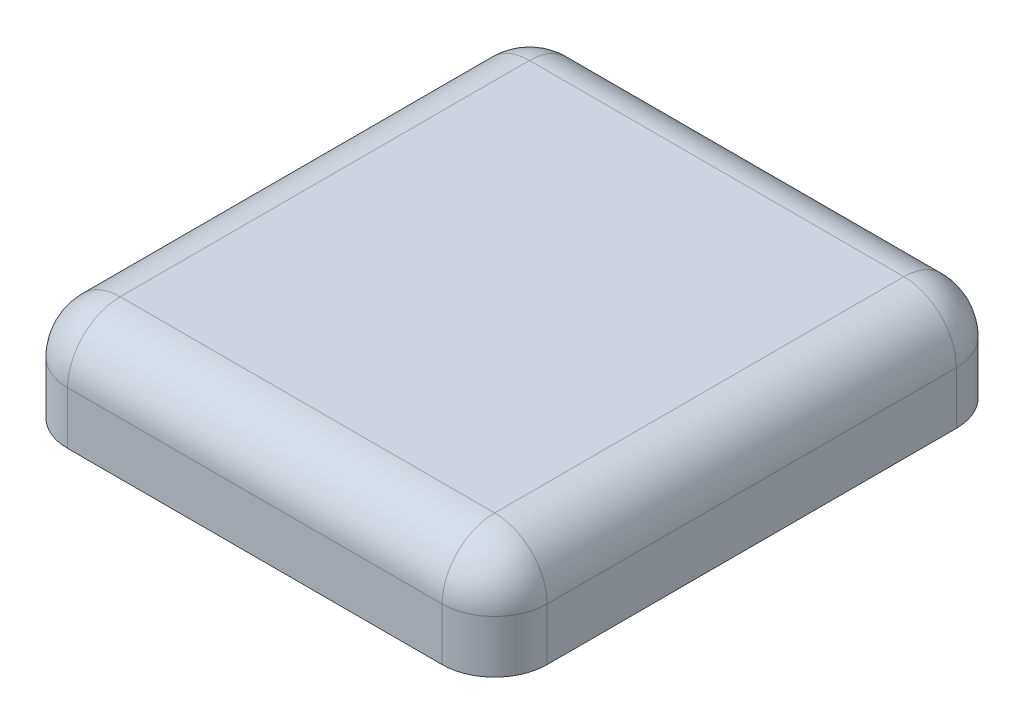
ISO-10303-21;
HEADER;
FILE_DESCRIPTION(('STEP AP214'),'2;1');
FILE_NAME('part.step','',(''),(''),'','','');
FILE_SCHEMA(('AUTOMOTIVE_DESIGN { 1 0 10303 214 1 1 1 1 }'));
ENDSEC;
DATA;
#1=APPLICATION_CONTEXT('core data for automotive mechanical design processes');
#2=APPLICATION_PROTOCOL_DEFINITION('international standard','automotive_design',2000,#1);
#3=PRODUCT_CONTEXT('',#1,'mechanical');
#4=PRODUCT('Part','Part','',(#3));
#5=PRODUCT_RELATED_PRODUCT_CATEGORY('part','',(#4));
#6=PRODUCT_DEFINITION_FORMATION('','',#4);
#7=PRODUCT_DEFINITION_CONTEXT('part definition',#1,'design');
#8=PRODUCT_DEFINITION('design','',#6,#7);
#9=PRODUCT_DEFINITION_SHAPE('','',#8);
#10=(LENGTH_UNIT() NAMED_UNIT(*) SI_UNIT(.MILLI.,.METRE.));
#11=(NAMED_UNIT(*) PLANE_ANGLE_UNIT() SI_UNIT($,.RADIAN.));
#12=(NAMED_UNIT(*) SI_UNIT($,.STERADIAN.) SOLID_ANGLE_UNIT());
#13=UNCERTAINTY_MEASURE_WITH_UNIT(LENGTH_MEASURE(1.E-05),#10,'distance_accuracy_value','');
#14=(GEOMETRIC_REPRESENTATION_CONTEXT(3) GLOBAL_UNCERTAINTY_ASSIGNED_CONTEXT((#13)) GLOBAL_UNIT_ASSIGNED_CONTEXT((#10,
#11,#12)) REPRESENTATION_CONTEXT('',''));
#15=CARTESIAN_POINT('',(0.,0.,0.));
#16=DIRECTION('',(0.,0.,1.));
#17=DIRECTION('',(1.,0.,0.));
#18=AXIS2_PLACEMENT_3D('',#15,#16,#17);
#19=CARTESIAN_POINT('',(0.,2.,0.));
#20=DIRECTION('',(0.,1.,0.));
#21=DIRECTION('',(0.,0.,1.));
#22=AXIS2_PLACEMENT_3D('',#19,#20,#21);
#23=PLANE('',#22);
#24=DIRECTION('',(0.,0.,1.));
#25=VECTOR('',#24,1.);
#26=CARTESIAN_POINT('',(-17.3837209302325,2.,0.));
#27=LINE('',#26,#25);
#28=CARTESIAN_POINT('',(-17.3837209302325,2.,-18.3349688339604));
#29=VERTEX_POINT('',#28);
#30=CARTESIAN_POINT('',(-17.3837209302325,2.,20.5988372093023));
#31=VERTEX_POINT('',#30);
#32=EDGE_CURVE('E218',#29,#31,#27,.T.);
#33=ORIENTED_EDGE('',*,*,#32,.T.);
#34=DIRECTION('',(1.,0.,0.));
#35=VECTOR('',#34,1.);
#36=CARTESIAN_POINT('',(0.,2.,20.5988372093023));
#37=LINE('',#36,#35);
#38=CARTESIAN_POINT('',(18.2443290602305,2.,20.5988372093023));
#39=VERTEX_POINT('',#38);
#40=EDGE_CURVE('E220',#31,#39,#37,.T.);
#41=ORIENTED_EDGE('',*,*,#40,.T.);
#42=DIRECTION('',(0.,0.,1.));
#43=VECTOR('',#42,1.);
#44=CARTESIAN_POINT('',(18.2443290602305,2.,0.));
#45=LINE('',#44,#43);
#46=CARTESIAN_POINT('',(18.2443290602305,2.,-18.3349688339604));
#47=VERTEX_POINT('',#46);
#48=EDGE_CURVE('E214',#39,#47,#45,.F.);
#49=ORIENTED_EDGE('',*,*,#48,.T.);
#50=DIRECTION('',(-1.,0.,0.));
#51=VECTOR('',#50,1.);
#52=CARTESIAN_POINT('',(0.,2.,-18.3349688339604));
#53=LINE('',#52,#51);
#54=EDGE_CURVE('E216',#47,#29,#53,.T.);
#55=ORIENTED_EDGE('',*,*,#54,.T.);
#56=EDGE_LOOP('',(#33,#41,#49,#55));
#57=FACE_BOUND('',#56,.T.);
#58=ADVANCED_FACE('F33',(#57),#23,.T.);
#59=CARTESIAN_POINT('',(0.,0.,0.));
#60=DIRECTION('',(0.,1.,0.));
#61=DIRECTION('',(0.,0.,1.));
#62=AXIS2_PLACEMENT_3D('',#59,#60,#61);
#63=PLANE('',#62);
#64=DIRECTION('',(1.,0.,0.));
#65=VECTOR('',#64,1.);
#66=CARTESIAN_POINT('',(-20.3837209302325,0.,23.5988372093023));
#67=LINE('',#66,#65);
#68=CARTESIAN_POINT('',(-18.3837209302325,0.,23.5988372093023));
#69=VERTEX_POINT('',#68);
#70=CARTESIAN_POINT('',(18.6162790697675,0.,23.5988372093023));
#71=VERTEX_POINT('',#70);
#72=EDGE_CURVE('E306',#69,#71,#67,.T.);
#73=ORIENTED_EDGE('',*,*,#72,.F.);
#74=CARTESIAN_POINT('',(-18.3837209302325,0.,21.5988372093023));
#75=DIRECTION('',(0.,1.,0.));
#76=DIRECTION('',(0.,0.,1.));
#77=AXIS2_PLACEMENT_3D('',#74,#75,#76);
#78=CIRCLE('',#77,2.);
#79=CARTESIAN_POINT('',(-20.3837209302325,0.,21.5988372093023));
#80=VERTEX_POINT('',#79);
#81=EDGE_CURVE('E267',#69,#80,#78,.F.);
#82=ORIENTED_EDGE('',*,*,#81,.T.);
#83=DIRECTION('',(0.,0.,1.));
#84=VECTOR('',#83,1.);
#85=CARTESIAN_POINT('',(-20.3837209302325,0.,-21.4011627906977));
#86=LINE('',#85,#84);
#87=CARTESIAN_POINT('',(-20.3837209302325,0.,-19.4011627906977));
#88=VERTEX_POINT('',#87);
#89=EDGE_CURVE('E309',#88,#80,#86,.T.);
#90=ORIENTED_EDGE('',*,*,#89,.F.);
#91=CARTESIAN_POINT('',(-18.3837209302325,0.,-19.4011627906977));
#92=DIRECTION('',(0.,1.,0.));
#93=DIRECTION('',(0.,0.,1.));
#94=AXIS2_PLACEMENT_3D('',#91,#92,#93);
#95=CIRCLE('',#94,2.);
#96=CARTESIAN_POINT('',(-18.3837209302325,0.,-21.4011627906977));
#97=VERTEX_POINT('',#96);
#98=EDGE_CURVE('E265',#88,#97,#95,.F.);
#99=ORIENTED_EDGE('',*,*,#98,.T.);
#100=DIRECTION('',(-1.,0.,0.));
#101=VECTOR('',#100,1.);
#102=CARTESIAN_POINT('',(-20.3837209302325,0.,-21.4011627906977));
#103=LINE('',#102,#101);
#104=CARTESIAN_POINT('',(18.6162790697675,0.,-21.4011627906977));
#105=VERTEX_POINT('',#104);
#106=EDGE_CURVE('E189',#105,#97,#103,.T.);
#107=ORIENTED_EDGE('',*,*,#106,.F.);
#108=CARTESIAN_POINT('',(18.6162790697675,0.,-19.4011627906977));
#109=DIRECTION('',(0.,1.,0.));
#110=DIRECTION('',(0.,0.,1.));
#111=AXIS2_PLACEMENT_3D('',#108,#109,#110);
#112=CIRCLE('',#111,2.);
#113=CARTESIAN_POINT('',(20.6162790697675,0.,-19.4011627906977));
#114=VERTEX_POINT('',#113);
#115=EDGE_CURVE('E263',#105,#114,#112,.F.);
#116=ORIENTED_EDGE('',*,*,#115,.T.);
#117=DIRECTION('',(0.,0.,-1.));
#118=VECTOR('',#117,1.);
#119=CARTESIAN_POINT('',(20.6162790697675,0.,-21.4011627906977));
#120=LINE('',#119,#118);
#121=CARTESIAN_POINT('',(20.6162790697675,0.,21.5988372093023));
#122=VERTEX_POINT('',#121);
#123=EDGE_CURVE('E302',#122,#114,#120,.T.);
#124=ORIENTED_EDGE('',*,*,#123,.F.);
#125=CARTESIAN_POINT('',(18.6162790697675,0.,21.5988372093023));
#126=DIRECTION('',(0.,1.,0.));
#127=DIRECTION('',(0.,0.,1.));
#128=AXIS2_PLACEMENT_3D('',#125,#126,#127);
#129=CIRCLE('',#128,2.);
#130=EDGE_CURVE('E261',#122,#71,#129,.F.);
#131=ORIENTED_EDGE('',*,*,#130,.T.);
#132=EDGE_LOOP('',(#73,#82,#90,#99,#107,#116,#124,#131));
#133=FACE_BOUND('',#132,.T.);
#134=ADVANCED_FACE('F301',(#133),#63,.F.);
#135=CARTESIAN_POINT('',(-20.3837209302325,-8.,23.5988372093023));
#136=DIRECTION('',(0.,0.,-1.));
#137=DIRECTION('',(-1.,0.,0.));
#138=AXIS2_PLACEMENT_3D('',#135,#136,#137);
#139=PLANE('',#138);
#140=DIRECTION('',(-1.,0.,0.));
#141=VECTOR('',#140,1.);
#142=CARTESIAN_POINT('',(-20.3837209302325,-8.,23.5988372093023));
#143=LINE('',#142,#141);
#144=CARTESIAN_POINT('',(18.6162790697675,-8.,23.5988372093023));
#145=VERTEX_POINT('',#144);
#146=CARTESIAN_POINT('',(-18.3837209302325,-8.,23.5988372093023));
#147=VERTEX_POINT('',#146);
#148=EDGE_CURVE('E314',#145,#147,#143,.T.);
#149=ORIENTED_EDGE('',*,*,#148,.T.);
#150=DIRECTION('',(0.,1.,0.));
#151=VECTOR('',#150,1.);
#152=CARTESIAN_POINT('',(-18.3837209302325,0.,23.5988372093023));
#153=LINE('',#152,#151);
#154=EDGE_CURVE('E258',#147,#69,#153,.T.);
#155=ORIENTED_EDGE('',*,*,#154,.T.);
#156=ORIENTED_EDGE('',*,*,#72,.T.);
#157=DIRECTION('',(0.,1.,0.));
#158=VECTOR('',#157,1.);
#159=CARTESIAN_POINT('',(18.6162790697675,-8.,23.5988372093023));
#160=LINE('',#159,#158);
#161=EDGE_CURVE('E223',#71,#145,#160,.F.);
#162=ORIENTED_EDGE('',*,*,#161,.T.);
#163=EDGE_LOOP('',(#149,#155,#156,#162));
#164=FACE_BOUND('',#163,.T.);
#165=ADVANCED_FACE('F340',(#164),#139,.T.);
#166=CARTESIAN_POINT('',(-20.3837209302325,-8.,25.5988372093023));
#167=DIRECTION('',(0.,0.,1.));
#168=DIRECTION('',(1.,0.,0.));
#169=AXIS2_PLACEMENT_3D('',#166,#167,#168);
#170=PLANE('',#169);
#171=DIRECTION('',(1.,0.,0.));
#172=VECTOR('',#171,1.);
#173=CARTESIAN_POINT('',(-20.3837209302325,-8.,25.5988372093023));
#174=LINE('',#173,#172);
#175=CARTESIAN_POINT('',(-17.3837209302325,-8.,25.5988372093023));
#176=VERTEX_POINT('',#175);
#177=CARTESIAN_POINT('',(18.2443290602305,-8.,25.5988372093023));
#178=VERTEX_POINT('',#177);
#179=EDGE_CURVE('E317',#176,#178,#174,.T.);
#180=ORIENTED_EDGE('',*,*,#179,.T.);
#181=DIRECTION('',(0.,-1.,0.));
#182=VECTOR('',#181,1.);
#183=CARTESIAN_POINT('',(18.2443290602305,-8.,25.5988372093023));
#184=LINE('',#183,#182);
#185=CARTESIAN_POINT('',(18.2443290602305,-3.,25.5988372093023));
#186=VERTEX_POINT('',#185);
#187=EDGE_CURVE('E200',#178,#186,#184,.F.);
#188=ORIENTED_EDGE('',*,*,#187,.T.);
#189=DIRECTION('',(1.,0.,0.));
#190=VECTOR('',#189,1.);
#191=CARTESIAN_POINT('',(-20.3837209302325,-3.,25.5988372093023));
#192=LINE('',#191,#190);
#193=CARTESIAN_POINT('',(-17.3837209302325,-3.,25.5988372093023));
#194=VERTEX_POINT('',#193);
#195=EDGE_CURVE('E196',#186,#194,#192,.F.);
#196=ORIENTED_EDGE('',*,*,#195,.T.);
#197=DIRECTION('',(0.,1.,0.));
#198=VECTOR('',#197,1.);
#199=CARTESIAN_POINT('',(-17.3837209302325,-8.,25.5988372093023));
#200=LINE('',#199,#198);
#201=EDGE_CURVE('E198',#194,#176,#200,.F.);
#202=ORIENTED_EDGE('',*,*,#201,.T.);
#203=EDGE_LOOP('',(#180,#188,#196,#202));
#204=FACE_BOUND('',#203,.T.);
#205=ADVANCED_FACE('F355',(#204),#170,.T.);
#206=CARTESIAN_POINT('',(0.,-8.,0.));
#207=DIRECTION('',(0.,1.,0.));
#208=DIRECTION('',(0.,0.,1.));
#209=AXIS2_PLACEMENT_3D('',#206,#207,#208);
#210=PLANE('',#209);
#211=DIRECTION('',(0.,0.,1.));
#212=VECTOR('',#211,1.);
#213=CARTESIAN_POINT('',(23.2443290602305,-8.,25.5988372093023));
#214=LINE('',#213,#212);
#215=CARTESIAN_POINT('',(23.2443290602305,-8.,-18.3349688339604));
#216=VERTEX_POINT('',#215);
#217=CARTESIAN_POINT('',(23.2443290602305,-8.,20.5988372093023));
#218=VERTEX_POINT('',#217);
#219=EDGE_CURVE('E162',#216,#218,#214,.T.);
#220=ORIENTED_EDGE('',*,*,#219,.T.);
#221=CARTESIAN_POINT('',(18.2443290602305,-8.,20.5988372093023));
#222=DIRECTION('',(0.,1.,0.));
#223=DIRECTION('',(0.,0.,1.));
#224=AXIS2_PLACEMENT_3D('',#221,#222,#223);
#225=CIRCLE('',#224,5.);
#226=EDGE_CURVE('E168',#218,#178,#225,.F.);
#227=ORIENTED_EDGE('',*,*,#226,.T.);
#228=ORIENTED_EDGE('',*,*,#179,.F.);
#229=CARTESIAN_POINT('',(-17.3837209302325,-8.,20.5988372093023));
#230=DIRECTION('',(0.,1.,0.));
#231=DIRECTION('',(0.,0.,1.));
#232=AXIS2_PLACEMENT_3D('',#229,#230,#231);
#233=CIRCLE('',#232,5.);
#234=CARTESIAN_POINT('',(-22.3837209302325,-8.,20.5988372093023));
#235=VERTEX_POINT('',#234);
#236=EDGE_CURVE('E169',#176,#235,#233,.F.);
#237=ORIENTED_EDGE('',*,*,#236,.T.);
#238=DIRECTION('',(0.,0.,1.));
#239=VECTOR('',#238,1.);
#240=CARTESIAN_POINT('',(-22.3837209302325,-8.,-23.3349688339604));
#241=LINE('',#240,#239);
#242=CARTESIAN_POINT('',(-22.3837209302325,-8.,-18.3349688339604));
#243=VERTEX_POINT('',#242);
#244=EDGE_CURVE('E320',#243,#235,#241,.T.);
#245=ORIENTED_EDGE('',*,*,#244,.F.);
#246=CARTESIAN_POINT('',(-17.3837209302325,-8.,-18.3349688339604));
#247=DIRECTION('',(0.,1.,0.));
#248=DIRECTION('',(0.,0.,1.));
#249=AXIS2_PLACEMENT_3D('',#246,#247,#248);
#250=CIRCLE('',#249,5.);
#251=CARTESIAN_POINT('',(-17.3837209302325,-8.,-23.3349688339604));
#252=VERTEX_POINT('',#251);
#253=EDGE_CURVE('E187',#243,#252,#250,.F.);
#254=ORIENTED_EDGE('',*,*,#253,.T.);
#255=DIRECTION('',(-1.,0.,0.));
#256=VECTOR('',#255,1.);
#257=CARTESIAN_POINT('',(-20.3837209302325,-8.,-23.3349688339604));
#258=LINE('',#257,#256);
#259=CARTESIAN_POINT('',(18.2443290602305,-8.,-23.3349688339604));
#260=VERTEX_POINT('',#259);
#261=EDGE_CURVE('E164',#260,#252,#258,.T.);
#262=ORIENTED_EDGE('',*,*,#261,.F.);
#263=CARTESIAN_POINT('',(18.2443290602305,-8.,-18.3349688339604));
#264=DIRECTION('',(0.,1.,0.));
#265=DIRECTION('',(0.,0.,1.));
#266=AXIS2_PLACEMENT_3D('',#263,#264,#265);
#267=CIRCLE('',#266,5.);
#268=EDGE_CURVE('E159',#260,#216,#267,.F.);
#269=ORIENTED_EDGE('',*,*,#268,.T.);
#270=EDGE_LOOP('',(#220,#227,#228,#237,#245,#254,#262,#269));
#271=FACE_BOUND('',#270,.T.);
#272=ORIENTED_EDGE('',*,*,#148,.F.);
#273=CARTESIAN_POINT('',(18.6162790697675,-8.,21.5988372093023));
#274=DIRECTION('',(0.,1.,0.));
#275=DIRECTION('',(0.,0.,1.));
#276=AXIS2_PLACEMENT_3D('',#273,#274,#275);
#277=CIRCLE('',#276,2.);
#278=CARTESIAN_POINT('',(20.6162790697675,-8.,21.5988372093023));
#279=VERTEX_POINT('',#278);
#280=EDGE_CURVE('E11',#145,#279,#277,.T.);
#281=ORIENTED_EDGE('',*,*,#280,.T.);
#282=DIRECTION('',(0.,0.,-1.));
#283=VECTOR('',#282,1.);
#284=CARTESIAN_POINT('',(20.6162790697675,-8.,25.5988372093023));
#285=LINE('',#284,#283);
#286=CARTESIAN_POINT('',(20.6162790697675,-8.,-19.4011627906977));
#287=VERTEX_POINT('',#286);
#288=EDGE_CURVE('E179',#279,#287,#285,.T.);
#289=ORIENTED_EDGE('',*,*,#288,.T.);
#290=CARTESIAN_POINT('',(18.6162790697675,-8.,-19.4011627906977));
#291=DIRECTION('',(0.,1.,0.));
#292=DIRECTION('',(0.,0.,1.));
#293=AXIS2_PLACEMENT_3D('',#290,#291,#292);
#294=CIRCLE('',#293,2.);
#295=CARTESIAN_POINT('',(18.6162790697675,-8.,-21.4011627906977));
#296=VERTEX_POINT('',#295);
#297=EDGE_CURVE('E41',#287,#296,#294,.T.);
#298=ORIENTED_EDGE('',*,*,#297,.T.);
#299=DIRECTION('',(-1.,0.,0.));
#300=VECTOR('',#299,1.);
#301=CARTESIAN_POINT('',(20.6162790697675,-8.,-21.4011627906977));
#302=LINE('',#301,#300);
#303=CARTESIAN_POINT('',(-18.3837209302325,-8.,-21.4011627906977));
#304=VERTEX_POINT('',#303);
#305=EDGE_CURVE('E178',#296,#304,#302,.T.);
#306=ORIENTED_EDGE('',*,*,#305,.T.);
#307=CARTESIAN_POINT('',(-18.3837209302325,-8.,-19.4011627906977));
#308=DIRECTION('',(0.,1.,0.));
#309=DIRECTION('',(0.,0.,1.));
#310=AXIS2_PLACEMENT_3D('',#307,#308,#309);
#311=CIRCLE('',#310,2.);
#312=CARTESIAN_POINT('',(-20.3837209302325,-8.,-19.4011627906977));
#313=VERTEX_POINT('',#312);
#314=EDGE_CURVE('E285',#304,#313,#311,.T.);
#315=ORIENTED_EDGE('',*,*,#314,.T.);
#316=DIRECTION('',(0.,0.,-1.));
#317=VECTOR('',#316,1.);
#318=CARTESIAN_POINT('',(-20.3837209302325,-8.,-23.3349688339604));
#319=LINE('',#318,#317);
#320=CARTESIAN_POINT('',(-20.3837209302325,-8.,21.5988372093023));
#321=VERTEX_POINT('',#320);
#322=EDGE_CURVE('E293',#321,#313,#319,.T.);
#323=ORIENTED_EDGE('',*,*,#322,.F.);
#324=CARTESIAN_POINT('',(-18.3837209302325,-8.,21.5988372093023));
#325=DIRECTION('',(0.,1.,0.));
#326=DIRECTION('',(0.,0.,1.));
#327=AXIS2_PLACEMENT_3D('',#324,#325,#326);
#328=CIRCLE('',#327,2.);
#329=EDGE_CURVE('E283',#321,#147,#328,.T.);
#330=ORIENTED_EDGE('',*,*,#329,.T.);
#331=EDGE_LOOP('',(#272,#281,#289,#298,#306,#315,#323,#330));
#332=FACE_BOUND('',#331,.T.);
#333=ADVANCED_FACE('F161',(#271,#332),#210,.F.);
#334=CARTESIAN_POINT('',(-20.3837209302325,-8.,-23.3349688339604));
#335=DIRECTION('',(1.,0.,0.));
#336=DIRECTION('',(0.,0.,-1.));
#337=AXIS2_PLACEMENT_3D('',#334,#335,#336);
#338=PLANE('',#337);
#339=ORIENTED_EDGE('',*,*,#89,.T.);
#340=DIRECTION('',(0.,1.,0.));
#341=VECTOR('',#340,1.);
#342=CARTESIAN_POINT('',(-20.3837209302325,-8.,21.5988372093023));
#343=LINE('',#342,#341);
#344=EDGE_CURVE('E271',#80,#321,#343,.F.);
#345=ORIENTED_EDGE('',*,*,#344,.T.);
#346=ORIENTED_EDGE('',*,*,#322,.T.);
#347=DIRECTION('',(0.,-1.,0.));
#348=VECTOR('',#347,1.);
#349=CARTESIAN_POINT('',(-20.3837209302325,0.,-19.4011627906977));
#350=LINE('',#349,#348);
#351=EDGE_CURVE('E269',#313,#88,#350,.F.);
#352=ORIENTED_EDGE('',*,*,#351,.T.);
#353=EDGE_LOOP('',(#339,#345,#346,#352));
#354=FACE_BOUND('',#353,.T.);
#355=ADVANCED_FACE('F329',(#354),#338,.T.);
#356=CARTESIAN_POINT('',(-22.3837209302325,-8.,-23.3349688339604));
#357=DIRECTION('',(-1.,0.,0.));
#358=DIRECTION('',(0.,0.,1.));
#359=AXIS2_PLACEMENT_3D('',#356,#357,#358);
#360=PLANE('',#359);
#361=ORIENTED_EDGE('',*,*,#244,.T.);
#362=DIRECTION('',(0.,1.,0.));
#363=VECTOR('',#362,1.);
#364=CARTESIAN_POINT('',(-22.3837209302325,-8.,20.5988372093023));
#365=LINE('',#364,#363);
#366=CARTESIAN_POINT('',(-22.3837209302325,-3.,20.5988372093023));
#367=VERTEX_POINT('',#366);
#368=EDGE_CURVE('E212',#235,#367,#365,.T.);
#369=ORIENTED_EDGE('',*,*,#368,.T.);
#370=DIRECTION('',(0.,0.,1.));
#371=VECTOR('',#370,1.);
#372=CARTESIAN_POINT('',(-22.3837209302325,-3.,-23.3349688339604));
#373=LINE('',#372,#371);
#374=CARTESIAN_POINT('',(-22.3837209302325,-3.,-18.3349688339604));
#375=VERTEX_POINT('',#374);
#376=EDGE_CURVE('E208',#367,#375,#373,.F.);
#377=ORIENTED_EDGE('',*,*,#376,.T.);
#378=DIRECTION('',(0.,1.,0.));
#379=VECTOR('',#378,1.);
#380=CARTESIAN_POINT('',(-22.3837209302325,-8.,-18.3349688339604));
#381=LINE('',#380,#379);
#382=EDGE_CURVE('E210',#375,#243,#381,.F.);
#383=ORIENTED_EDGE('',*,*,#382,.T.);
#384=EDGE_LOOP('',(#361,#369,#377,#383));
#385=FACE_BOUND('',#384,.T.);
#386=ADVANCED_FACE('F513',(#385),#360,.T.);
#387=CARTESIAN_POINT('',(-20.3837209302325,-8.,-23.3349688339604));
#388=DIRECTION('',(0.,0.,-1.));
#389=DIRECTION('',(-1.,0.,0.));
#390=AXIS2_PLACEMENT_3D('',#387,#388,#389);
#391=PLANE('',#390);
#392=DIRECTION('',(-1.,0.,0.));
#393=VECTOR('',#392,1.);
#394=CARTESIAN_POINT('',(-20.3837209302325,-3.,-23.3349688339604));
#395=LINE('',#394,#393);
#396=CARTESIAN_POINT('',(-17.3837209302325,-3.,-23.3349688339604));
#397=VERTEX_POINT('',#396);
#398=CARTESIAN_POINT('',(18.2443290602305,-3.,-23.3349688339604));
#399=VERTEX_POINT('',#398);
#400=EDGE_CURVE('E202',#397,#399,#395,.F.);
#401=ORIENTED_EDGE('',*,*,#400,.T.);
#402=DIRECTION('',(0.,-1.,0.));
#403=VECTOR('',#402,1.);
#404=CARTESIAN_POINT('',(18.2443290602305,-8.,-23.3349688339604));
#405=LINE('',#404,#403);
#406=EDGE_CURVE('E206',#399,#260,#405,.T.);
#407=ORIENTED_EDGE('',*,*,#406,.T.);
#408=ORIENTED_EDGE('',*,*,#261,.T.);
#409=DIRECTION('',(0.,1.,0.));
#410=VECTOR('',#409,1.);
#411=CARTESIAN_POINT('',(-17.3837209302325,-8.,-23.3349688339604));
#412=LINE('',#411,#410);
#413=EDGE_CURVE('E204',#252,#397,#412,.T.);
#414=ORIENTED_EDGE('',*,*,#413,.T.);
#415=EDGE_LOOP('',(#401,#407,#408,#414));
#416=FACE_BOUND('',#415,.T.);
#417=ADVANCED_FACE('F507',(#416),#391,.T.);
#418=CARTESIAN_POINT('',(20.6162790697675,2.,-21.4011627906977));
#419=DIRECTION('',(0.,0.,1.));
#420=DIRECTION('',(1.,0.,0.));
#421=AXIS2_PLACEMENT_3D('',#418,#419,#420);
#422=PLANE('',#421);
#423=ORIENTED_EDGE('',*,*,#106,.T.);
#424=DIRECTION('',(0.,-1.,0.));
#425=VECTOR('',#424,1.);
#426=CARTESIAN_POINT('',(-18.3837209302325,-8.,-21.4011627906977));
#427=LINE('',#426,#425);
#428=EDGE_CURVE('E275',#97,#304,#427,.T.);
#429=ORIENTED_EDGE('',*,*,#428,.T.);
#430=ORIENTED_EDGE('',*,*,#305,.F.);
#431=DIRECTION('',(0.,-1.,0.));
#432=VECTOR('',#431,1.);
#433=CARTESIAN_POINT('',(18.6162790697675,0.,-21.4011627906977));
#434=LINE('',#433,#432);
#435=EDGE_CURVE('E273',#296,#105,#434,.F.);
#436=ORIENTED_EDGE('',*,*,#435,.T.);
#437=EDGE_LOOP('',(#423,#429,#430,#436));
#438=FACE_BOUND('',#437,.T.);
#439=ADVANCED_FACE('F290',(#438),#422,.T.);
#440=CARTESIAN_POINT('',(20.6162790697675,2.,25.5988372093023));
#441=DIRECTION('',(-1.,0.,0.));
#442=DIRECTION('',(0.,0.,1.));
#443=AXIS2_PLACEMENT_3D('',#440,#441,#442);
#444=PLANE('',#443);
#445=ORIENTED_EDGE('',*,*,#123,.T.);
#446=DIRECTION('',(0.,-1.,0.));
#447=VECTOR('',#446,1.);
#448=CARTESIAN_POINT('',(20.6162790697675,-8.,-19.4011627906977));
#449=LINE('',#448,#447);
#450=EDGE_CURVE('E281',#114,#287,#449,.T.);
#451=ORIENTED_EDGE('',*,*,#450,.T.);
#452=ORIENTED_EDGE('',*,*,#288,.F.);
#453=DIRECTION('',(0.,1.,0.));
#454=VECTOR('',#453,1.);
#455=CARTESIAN_POINT('',(20.6162790697675,0.,21.5988372093023));
#456=LINE('',#455,#454);
#457=EDGE_CURVE('E278',#279,#122,#456,.T.);
#458=ORIENTED_EDGE('',*,*,#457,.T.);
#459=EDGE_LOOP('',(#445,#451,#452,#458));
#460=FACE_BOUND('',#459,.T.);
#461=ADVANCED_FACE('F304',(#460),#444,.T.);
#462=CARTESIAN_POINT('',(23.2443290602305,2.,25.5988372093023));
#463=DIRECTION('',(1.,0.,0.));
#464=DIRECTION('',(0.,0.,-1.));
#465=AXIS2_PLACEMENT_3D('',#462,#463,#464);
#466=PLANE('',#465);
#467=DIRECTION('',(0.,0.,1.));
#468=VECTOR('',#467,1.);
#469=CARTESIAN_POINT('',(23.2443290602305,-3.,25.5988372093023));
#470=LINE('',#469,#468);
#471=CARTESIAN_POINT('',(23.2443290602305,-3.,-18.3349688339604));
#472=VERTEX_POINT('',#471);
#473=CARTESIAN_POINT('',(23.2443290602305,-3.,20.5988372093023));
#474=VERTEX_POINT('',#473);
#475=EDGE_CURVE('E185',#472,#474,#470,.T.);
#476=ORIENTED_EDGE('',*,*,#475,.T.);
#477=DIRECTION('',(0.,-1.,0.));
#478=VECTOR('',#477,1.);
#479=CARTESIAN_POINT('',(23.2443290602305,2.,20.5988372093023));
#480=LINE('',#479,#478);
#481=EDGE_CURVE('E177',#474,#218,#480,.T.);
#482=ORIENTED_EDGE('',*,*,#481,.T.);
#483=ORIENTED_EDGE('',*,*,#219,.F.);
#484=DIRECTION('',(0.,-1.,0.));
#485=VECTOR('',#484,1.);
#486=CARTESIAN_POINT('',(23.2443290602305,2.,-18.3349688339604));
#487=LINE('',#486,#485);
#488=EDGE_CURVE('E174',#216,#472,#487,.F.);
#489=ORIENTED_EDGE('',*,*,#488,.T.);
#490=EDGE_LOOP('',(#476,#482,#483,#489));
#491=FACE_BOUND('',#490,.T.);
#492=ADVANCED_FACE('F173',(#491),#466,.T.);
#493=CARTESIAN_POINT('',(-17.3837209302325,-8.,-18.3349688339604));
#494=DIRECTION('',(0.,1.,0.));
#495=DIRECTION('',(0.,0.,1.));
#496=AXIS2_PLACEMENT_3D('',#493,#494,#495);
#497=CYLINDRICAL_SURFACE('',#496,5.);
#498=CARTESIAN_POINT('',(-17.3837209302325,-3.,-18.3349688339604));
#499=DIRECTION('',(0.,1.,0.));
#500=DIRECTION('',(0.,0.,1.));
#501=AXIS2_PLACEMENT_3D('',#498,#499,#500);
#502=CIRCLE('',#501,5.);
#503=EDGE_CURVE('E254',#397,#375,#502,.T.);
#504=ORIENTED_EDGE('',*,*,#503,.F.);
#505=ORIENTED_EDGE('',*,*,#413,.F.);
#506=ORIENTED_EDGE('',*,*,#253,.F.);
#507=ORIENTED_EDGE('',*,*,#382,.F.);
#508=EDGE_LOOP('',(#504,#505,#506,#507));
#509=FACE_BOUND('',#508,.T.);
#510=ADVANCED_FACE('F399',(#509),#497,.T.);
#511=CARTESIAN_POINT('',(-17.3837209302325,-3.,-18.3349688339604));
#512=DIRECTION('',(0.,0.,1.));
#513=DIRECTION('',(1.,0.,0.));
#514=AXIS2_PLACEMENT_3D('',#511,#512,#513);
#515=SPHERICAL_SURFACE('',#514,5.);
#516=CARTESIAN_POINT('',(-17.3837209302325,-3.,-18.3349688339604));
#517=DIRECTION('',(-1.,0.,0.));
#518=DIRECTION('',(0.,0.,1.));
#519=AXIS2_PLACEMENT_3D('',#516,#517,#518);
#520=CIRCLE('',#519,5.);
#521=EDGE_CURVE('E248',#397,#29,#520,.F.);
#522=ORIENTED_EDGE('',*,*,#521,.F.);
#523=ORIENTED_EDGE('',*,*,#503,.T.);
#524=CARTESIAN_POINT('',(-17.3837209302325,-3.,-18.3349688339604));
#525=DIRECTION('',(0.,0.,-1.));
#526=DIRECTION('',(-1.,0.,0.));
#527=AXIS2_PLACEMENT_3D('',#524,#525,#526);
#528=CIRCLE('',#527,5.);
#529=EDGE_CURVE('E251',#29,#375,#528,.F.);
#530=ORIENTED_EDGE('',*,*,#529,.F.);
#531=EDGE_LOOP('',(#522,#523,#530));
#532=FACE_BOUND('',#531,.T.);
#533=ADVANCED_FACE('F395',(#532),#515,.T.);
#534=CARTESIAN_POINT('',(-17.3837209302325,-8.,20.5988372093023));
#535=DIRECTION('',(0.,1.,0.));
#536=DIRECTION('',(0.,0.,1.));
#537=AXIS2_PLACEMENT_3D('',#534,#535,#536);
#538=CYLINDRICAL_SURFACE('',#537,5.);
#539=ORIENTED_EDGE('',*,*,#236,.F.);
#540=ORIENTED_EDGE('',*,*,#201,.F.);
#541=CARTESIAN_POINT('',(-17.3837209302325,-3.,20.5988372093023));
#542=DIRECTION('',(0.,1.,0.));
#543=DIRECTION('',(0.,0.,1.));
#544=AXIS2_PLACEMENT_3D('',#541,#542,#543);
#545=CIRCLE('',#544,5.);
#546=EDGE_CURVE('E245',#367,#194,#545,.T.);
#547=ORIENTED_EDGE('',*,*,#546,.F.);
#548=ORIENTED_EDGE('',*,*,#368,.F.);
#549=EDGE_LOOP('',(#539,#540,#547,#548));
#550=FACE_BOUND('',#549,.T.);
#551=ADVANCED_FACE('F391',(#550),#538,.T.);
#552=CARTESIAN_POINT('',(-17.3837209302325,-3.,0.));
#553=DIRECTION('',(0.,0.,1.));
#554=DIRECTION('',(1.,0.,0.));
#555=AXIS2_PLACEMENT_3D('',#552,#553,#554);
#556=CYLINDRICAL_SURFACE('',#555,5.);
#557=ORIENTED_EDGE('',*,*,#529,.T.);
#558=ORIENTED_EDGE('',*,*,#376,.F.);
#559=CARTESIAN_POINT('',(-17.3837209302325,-3.,20.5988372093023));
#560=DIRECTION('',(0.,0.,1.));
#561=DIRECTION('',(1.,0.,0.));
#562=AXIS2_PLACEMENT_3D('',#559,#560,#561);
#563=CIRCLE('',#562,5.);
#564=EDGE_CURVE('E242',#31,#367,#563,.T.);
#565=ORIENTED_EDGE('',*,*,#564,.F.);
#566=ORIENTED_EDGE('',*,*,#32,.F.);
#567=EDGE_LOOP('',(#557,#558,#565,#566));
#568=FACE_BOUND('',#567,.T.);
#569=ADVANCED_FACE('F387',(#568),#556,.T.);
#570=CARTESIAN_POINT('',(0.,-3.,-18.3349688339604));
#571=DIRECTION('',(-1.,0.,0.));
#572=DIRECTION('',(0.,0.,1.));
#573=AXIS2_PLACEMENT_3D('',#570,#571,#572);
#574=CYLINDRICAL_SURFACE('',#573,5.);
#575=ORIENTED_EDGE('',*,*,#521,.T.);
#576=ORIENTED_EDGE('',*,*,#54,.F.);
#577=CARTESIAN_POINT('',(18.2443290602305,-3.,-18.3349688339604));
#578=DIRECTION('',(1.,0.,0.));
#579=DIRECTION('',(0.,0.,-1.));
#580=AXIS2_PLACEMENT_3D('',#577,#578,#579);
#581=CIRCLE('',#580,5.);
#582=EDGE_CURVE('E239',#399,#47,#581,.T.);
#583=ORIENTED_EDGE('',*,*,#582,.F.);
#584=ORIENTED_EDGE('',*,*,#400,.F.);
#585=EDGE_LOOP('',(#575,#576,#583,#584));
#586=FACE_BOUND('',#585,.T.);
#587=ADVANCED_FACE('F384',(#586),#574,.T.);
#588=CARTESIAN_POINT('',(18.2443290602305,-8.,-18.3349688339604));
#589=DIRECTION('',(0.,-1.,0.));
#590=DIRECTION('',(0.,0.,-1.));
#591=AXIS2_PLACEMENT_3D('',#588,#589,#590);
#592=CYLINDRICAL_SURFACE('',#591,5.);
#593=ORIENTED_EDGE('',*,*,#268,.F.);
#594=ORIENTED_EDGE('',*,*,#406,.F.);
#595=CARTESIAN_POINT('',(18.2443290602305,-3.,-18.3349688339604));
#596=DIRECTION('',(0.,1.,0.));
#597=DIRECTION('',(0.,0.,1.));
#598=AXIS2_PLACEMENT_3D('',#595,#596,#597);
#599=CIRCLE('',#598,5.);
#600=EDGE_CURVE('E183',#472,#399,#599,.T.);
#601=ORIENTED_EDGE('',*,*,#600,.F.);
#602=ORIENTED_EDGE('',*,*,#488,.F.);
#603=EDGE_LOOP('',(#593,#594,#601,#602));
#604=FACE_BOUND('',#603,.T.);
#605=ADVANCED_FACE('F181',(#604),#592,.T.);
#606=CARTESIAN_POINT('',(-17.3837209302325,-3.,20.5988372093023));
#607=DIRECTION('',(0.,0.,1.));
#608=DIRECTION('',(1.,0.,0.));
#609=AXIS2_PLACEMENT_3D('',#606,#607,#608);
#610=SPHERICAL_SURFACE('',#609,5.);
#611=ORIENTED_EDGE('',*,*,#564,.T.);
#612=ORIENTED_EDGE('',*,*,#546,.T.);
#613=CARTESIAN_POINT('',(-17.3837209302325,-3.,20.5988372093023));
#614=DIRECTION('',(-1.,0.,0.));
#615=DIRECTION('',(0.,0.,1.));
#616=AXIS2_PLACEMENT_3D('',#613,#614,#615);
#617=CIRCLE('',#616,5.);
#618=EDGE_CURVE('E235',#31,#194,#617,.F.);
#619=ORIENTED_EDGE('',*,*,#618,.F.);
#620=EDGE_LOOP('',(#611,#612,#619));
#621=FACE_BOUND('',#620,.T.);
#622=ADVANCED_FACE('F377',(#621),#610,.T.);
#623=CARTESIAN_POINT('',(18.2443290602305,-3.,-18.3349688339604));
#624=DIRECTION('',(0.,0.,1.));
#625=DIRECTION('',(1.,0.,0.));
#626=AXIS2_PLACEMENT_3D('',#623,#624,#625);
#627=SPHERICAL_SURFACE('',#626,5.);
#628=ORIENTED_EDGE('',*,*,#600,.T.);
#629=ORIENTED_EDGE('',*,*,#582,.T.);
#630=CARTESIAN_POINT('',(18.2443290602305,-3.,-18.3349688339604));
#631=DIRECTION('',(0.,0.,-1.));
#632=DIRECTION('',(-1.,0.,0.));
#633=AXIS2_PLACEMENT_3D('',#630,#631,#632);
#634=CIRCLE('',#633,5.);
#635=EDGE_CURVE('E232',#472,#47,#634,.F.);
#636=ORIENTED_EDGE('',*,*,#635,.F.);
#637=EDGE_LOOP('',(#628,#629,#636));
#638=FACE_BOUND('',#637,.T.);
#639=ADVANCED_FACE('F373',(#638),#627,.T.);
#640=CARTESIAN_POINT('',(0.,-3.,20.5988372093023));
#641=DIRECTION('',(1.,0.,0.));
#642=DIRECTION('',(0.,0.,-1.));
#643=AXIS2_PLACEMENT_3D('',#640,#641,#642);
#644=CYLINDRICAL_SURFACE('',#643,5.);
#645=ORIENTED_EDGE('',*,*,#618,.T.);
#646=ORIENTED_EDGE('',*,*,#195,.F.);
#647=CARTESIAN_POINT('',(18.2443290602305,-3.,20.5988372093023));
#648=DIRECTION('',(1.,0.,0.));
#649=DIRECTION('',(0.,0.,-1.));
#650=AXIS2_PLACEMENT_3D('',#647,#648,#649);
#651=CIRCLE('',#650,5.);
#652=EDGE_CURVE('E229',#39,#186,#651,.T.);
#653=ORIENTED_EDGE('',*,*,#652,.F.);
#654=ORIENTED_EDGE('',*,*,#40,.F.);
#655=EDGE_LOOP('',(#645,#646,#653,#654));
#656=FACE_BOUND('',#655,.T.);
#657=ADVANCED_FACE('F369',(#656),#644,.T.);
#658=CARTESIAN_POINT('',(18.2443290602305,-3.,25.5988372093023));
#659=DIRECTION('',(0.,0.,1.));
#660=DIRECTION('',(1.,0.,0.));
#661=AXIS2_PLACEMENT_3D('',#658,#659,#660);
#662=CYLINDRICAL_SURFACE('',#661,5.);
#663=ORIENTED_EDGE('',*,*,#635,.T.);
#664=ORIENTED_EDGE('',*,*,#48,.F.);
#665=CARTESIAN_POINT('',(18.2443290602305,-3.,20.5988372093023));
#666=DIRECTION('',(0.,0.,1.));
#667=DIRECTION('',(1.,0.,0.));
#668=AXIS2_PLACEMENT_3D('',#665,#666,#667);
#669=CIRCLE('',#668,5.);
#670=EDGE_CURVE('E227',#474,#39,#669,.T.);
#671=ORIENTED_EDGE('',*,*,#670,.F.);
#672=ORIENTED_EDGE('',*,*,#475,.F.);
#673=EDGE_LOOP('',(#663,#664,#671,#672));
#674=FACE_BOUND('',#673,.T.);
#675=ADVANCED_FACE('F365',(#674),#662,.T.);
#676=CARTESIAN_POINT('',(18.2443290602305,-3.,20.5988372093023));
#677=DIRECTION('',(0.,0.,1.));
#678=DIRECTION('',(1.,0.,0.));
#679=AXIS2_PLACEMENT_3D('',#676,#677,#678);
#680=SPHERICAL_SURFACE('',#679,5.);
#681=ORIENTED_EDGE('',*,*,#670,.T.);
#682=ORIENTED_EDGE('',*,*,#652,.T.);
#683=CARTESIAN_POINT('',(18.2443290602305,-3.,20.5988372093023));
#684=DIRECTION('',(0.,1.,0.));
#685=DIRECTION('',(0.,0.,1.));
#686=AXIS2_PLACEMENT_3D('',#683,#684,#685);
#687=CIRCLE('',#686,5.);
#688=EDGE_CURVE('E224',#474,#186,#687,.F.);
#689=ORIENTED_EDGE('',*,*,#688,.F.);
#690=EDGE_LOOP('',(#681,#682,#689));
#691=FACE_BOUND('',#690,.T.);
#692=ADVANCED_FACE('F361',(#691),#680,.T.);
#693=CARTESIAN_POINT('',(18.2443290602305,2.,20.5988372093023));
#694=DIRECTION('',(0.,-1.,0.));
#695=DIRECTION('',(0.,0.,-1.));
#696=AXIS2_PLACEMENT_3D('',#693,#694,#695);
#697=CYLINDRICAL_SURFACE('',#696,5.);
#698=ORIENTED_EDGE('',*,*,#688,.T.);
#699=ORIENTED_EDGE('',*,*,#187,.F.);
#700=ORIENTED_EDGE('',*,*,#226,.F.);
#701=ORIENTED_EDGE('',*,*,#481,.F.);
#702=EDGE_LOOP('',(#698,#699,#700,#701));
#703=FACE_BOUND('',#702,.T.);
#704=ADVANCED_FACE('F358',(#703),#697,.T.);
#705=CARTESIAN_POINT('',(-18.3837209302325,-8.,21.5988372093023));
#706=DIRECTION('',(0.,-1.,0.));
#707=DIRECTION('',(0.,0.,-1.));
#708=AXIS2_PLACEMENT_3D('',#705,#706,#707);
#709=CYLINDRICAL_SURFACE('',#708,2.);
#710=ORIENTED_EDGE('',*,*,#329,.F.);
#711=ORIENTED_EDGE('',*,*,#344,.F.);
#712=ORIENTED_EDGE('',*,*,#81,.F.);
#713=ORIENTED_EDGE('',*,*,#154,.F.);
#714=EDGE_LOOP('',(#710,#711,#712,#713));
#715=FACE_BOUND('',#714,.T.);
#716=ADVANCED_FACE('F337',(#715),#709,.F.);
#717=CARTESIAN_POINT('',(-18.3837209302325,2.,-19.4011627906977));
#718=DIRECTION('',(0.,1.,0.));
#719=DIRECTION('',(0.,0.,1.));
#720=AXIS2_PLACEMENT_3D('',#717,#718,#719);
#721=CYLINDRICAL_SURFACE('',#720,2.);
#722=ORIENTED_EDGE('',*,*,#98,.F.);
#723=ORIENTED_EDGE('',*,*,#351,.F.);
#724=ORIENTED_EDGE('',*,*,#314,.F.);
#725=ORIENTED_EDGE('',*,*,#428,.F.);
#726=EDGE_LOOP('',(#722,#723,#724,#725));
#727=FACE_BOUND('',#726,.T.);
#728=ADVANCED_FACE('F335',(#727),#721,.F.);
#729=CARTESIAN_POINT('',(18.6162790697675,2.,-19.4011627906977));
#730=DIRECTION('',(0.,1.,0.));
#731=DIRECTION('',(0.,0.,1.));
#732=AXIS2_PLACEMENT_3D('',#729,#730,#731);
#733=CYLINDRICAL_SURFACE('',#732,2.);
#734=ORIENTED_EDGE('',*,*,#115,.F.);
#735=ORIENTED_EDGE('',*,*,#435,.F.);
#736=ORIENTED_EDGE('',*,*,#297,.F.);
#737=ORIENTED_EDGE('',*,*,#450,.F.);
#738=EDGE_LOOP('',(#734,#735,#736,#737));
#739=FACE_BOUND('',#738,.T.);
#740=ADVANCED_FACE('F296',(#739),#733,.F.);
#741=CARTESIAN_POINT('',(18.6162790697675,2.,21.5988372093023));
#742=DIRECTION('',(0.,-1.,0.));
#743=DIRECTION('',(0.,0.,-1.));
#744=AXIS2_PLACEMENT_3D('',#741,#742,#743);
#745=CYLINDRICAL_SURFACE('',#744,2.);
#746=ORIENTED_EDGE('',*,*,#280,.F.);
#747=ORIENTED_EDGE('',*,*,#161,.F.);
#748=ORIENTED_EDGE('',*,*,#130,.F.);
#749=ORIENTED_EDGE('',*,*,#457,.F.);
#750=EDGE_LOOP('',(#746,#747,#748,#749));
#751=FACE_BOUND('',#750,.T.);
#752=ADVANCED_FACE('F35',(#751),#745,.F.);
#753=CLOSED_SHELL('',(#58,#134,#165,#205,#333,#355,#386,#417,#439,#461,#492,#510,#533,#551,#569,
#587,#605,#622,#639,#657,#675,#692,#704,#716,#728,#740,#752));
#754=MANIFOLD_SOLID_BREP('B2',#753);
#755=ADVANCED_BREP_SHAPE_REPRESENTATION('',(#18,#754),#14);
#756=SHAPE_DEFINITION_REPRESENTATION(#9,#755);
ENDSEC;
END-ISO-10303-21;
